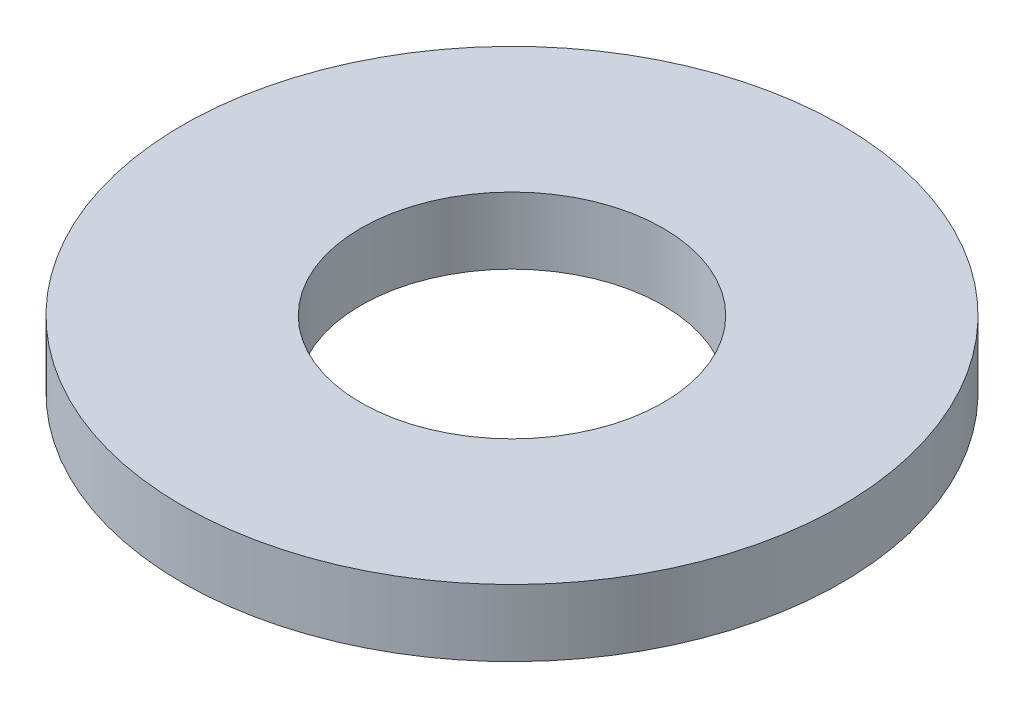
ISO-10303-21;
HEADER;
FILE_DESCRIPTION(('STEP AP214'),'2;1');
FILE_NAME('part.step','',(''),(''),'','','');
FILE_SCHEMA(('AUTOMOTIVE_DESIGN { 1 0 10303 214 1 1 1 1 }'));
ENDSEC;
DATA;
#1=APPLICATION_CONTEXT('core data for automotive mechanical design processes');
#2=APPLICATION_PROTOCOL_DEFINITION('international standard','automotive_design',2000,#1);
#3=PRODUCT_CONTEXT('',#1,'mechanical');
#4=PRODUCT('Part','Part','',(#3));
#5=PRODUCT_RELATED_PRODUCT_CATEGORY('part','',(#4));
#6=PRODUCT_DEFINITION_FORMATION('','',#4);
#7=PRODUCT_DEFINITION_CONTEXT('part definition',#1,'design');
#8=PRODUCT_DEFINITION('design','',#6,#7);
#9=PRODUCT_DEFINITION_SHAPE('','',#8);
#10=(LENGTH_UNIT() NAMED_UNIT(*) SI_UNIT(.MILLI.,.METRE.));
#11=(NAMED_UNIT(*) PLANE_ANGLE_UNIT() SI_UNIT($,.RADIAN.));
#12=(NAMED_UNIT(*) SI_UNIT($,.STERADIAN.) SOLID_ANGLE_UNIT());
#13=UNCERTAINTY_MEASURE_WITH_UNIT(LENGTH_MEASURE(1.E-05),#10,'distance_accuracy_value','');
#14=(GEOMETRIC_REPRESENTATION_CONTEXT(3) GLOBAL_UNCERTAINTY_ASSIGNED_CONTEXT((#13)) GLOBAL_UNIT_ASSIGNED_CONTEXT((#10,
#11,#12)) REPRESENTATION_CONTEXT('',''));
#15=CARTESIAN_POINT('',(0.,0.,0.));
#16=DIRECTION('',(0.,0.,1.));
#17=DIRECTION('',(1.,0.,0.));
#18=AXIS2_PLACEMENT_3D('',#15,#16,#17);
#19=CARTESIAN_POINT('',(0.,0.9652,0.));
#20=DIRECTION('',(0.,-1.,0.));
#21=DIRECTION('',(0.,0.,-1.));
#22=AXIS2_PLACEMENT_3D('',#19,#20,#21);
#23=CYLINDRICAL_SURFACE('',#22,4.7625);
#24=CARTESIAN_POINT('',(0.,0.9652,0.));
#25=DIRECTION('',(0.,1.,0.));
#26=DIRECTION('',(0.,0.,1.));
#27=AXIS2_PLACEMENT_3D('',#24,#25,#26);
#28=CIRCLE('',#27,4.7625);
#29=CARTESIAN_POINT('',(0.,0.9652,4.7625));
#30=VERTEX_POINT('',#29);
#31=EDGE_CURVE('E10',#30,#30,#28,.T.);
#32=ORIENTED_EDGE('',*,*,#31,.F.);
#33=EDGE_LOOP('',(#32));
#34=FACE_BOUND('',#33,.T.);
#35=CARTESIAN_POINT('',(0.,0.,0.));
#36=DIRECTION('',(0.,1.,0.));
#37=DIRECTION('',(0.,0.,1.));
#38=AXIS2_PLACEMENT_3D('',#35,#36,#37);
#39=CIRCLE('',#38,4.7625);
#40=CARTESIAN_POINT('',(0.,0.,4.7625));
#41=VERTEX_POINT('',#40);
#42=EDGE_CURVE('E37',#41,#41,#39,.T.);
#43=ORIENTED_EDGE('',*,*,#42,.T.);
#44=EDGE_LOOP('',(#43));
#45=FACE_BOUND('',#44,.T.);
#46=ADVANCED_FACE('F34',(#34,#45),#23,.T.);
#47=CARTESIAN_POINT('',(0.,0.9652,0.));
#48=DIRECTION('',(0.,1.,0.));
#49=DIRECTION('',(0.,0.,1.));
#50=AXIS2_PLACEMENT_3D('',#47,#48,#49);
#51=PLANE('',#50);
#52=CARTESIAN_POINT('',(0.,0.9652,0.));
#53=DIRECTION('',(0.,1.,0.));
#54=DIRECTION('',(0.,0.,1.));
#55=AXIS2_PLACEMENT_3D('',#52,#53,#54);
#56=CIRCLE('',#55,2.1844);
#57=CARTESIAN_POINT('',(0.,0.9652,2.1844));
#58=VERTEX_POINT('',#57);
#59=EDGE_CURVE('E49',#58,#58,#56,.T.);
#60=ORIENTED_EDGE('',*,*,#59,.F.);
#61=EDGE_LOOP('',(#60));
#62=FACE_BOUND('',#61,.T.);
#63=ORIENTED_EDGE('',*,*,#31,.T.);
#64=EDGE_LOOP('',(#63));
#65=FACE_BOUND('',#64,.T.);
#66=ADVANCED_FACE('F65',(#62,#65),#51,.T.);
#67=CARTESIAN_POINT('',(0.,0.,0.));
#68=DIRECTION('',(0.,1.,0.));
#69=DIRECTION('',(0.,0.,1.));
#70=AXIS2_PLACEMENT_3D('',#67,#68,#69);
#71=PLANE('',#70);
#72=CARTESIAN_POINT('',(0.,0.,0.));
#73=DIRECTION('',(0.,1.,0.));
#74=DIRECTION('',(0.,0.,1.));
#75=AXIS2_PLACEMENT_3D('',#72,#73,#74);
#76=CIRCLE('',#75,2.1844);
#77=CARTESIAN_POINT('',(0.,0.,2.1844));
#78=VERTEX_POINT('',#77);
#79=EDGE_CURVE('E47',#78,#78,#76,.T.);
#80=ORIENTED_EDGE('',*,*,#79,.T.);
#81=EDGE_LOOP('',(#80));
#82=FACE_BOUND('',#81,.T.);
#83=ORIENTED_EDGE('',*,*,#42,.F.);
#84=EDGE_LOOP('',(#83));
#85=FACE_BOUND('',#84,.T.);
#86=ADVANCED_FACE('F56',(#82,#85),#71,.F.);
#87=CARTESIAN_POINT('',(0.,0.,0.));
#88=DIRECTION('',(0.,1.,0.));
#89=DIRECTION('',(0.,0.,1.));
#90=AXIS2_PLACEMENT_3D('',#87,#88,#89);
#91=CYLINDRICAL_SURFACE('',#90,2.1844);
#92=ORIENTED_EDGE('',*,*,#79,.F.);
#93=EDGE_LOOP('',(#92));
#94=FACE_BOUND('',#93,.T.);
#95=ORIENTED_EDGE('',*,*,#59,.T.);
#96=EDGE_LOOP('',(#95));
#97=FACE_BOUND('',#96,.T.);
#98=ADVANCED_FACE('F59',(#94,#97),#91,.F.);
#99=CLOSED_SHELL('',(#46,#66,#86,#98));
#100=MANIFOLD_SOLID_BREP('B2',#99);
#101=ADVANCED_BREP_SHAPE_REPRESENTATION('',(#18,#100),#14);
#102=SHAPE_DEFINITION_REPRESENTATION(#9,#101);
ENDSEC;
END-ISO-10303-21;
